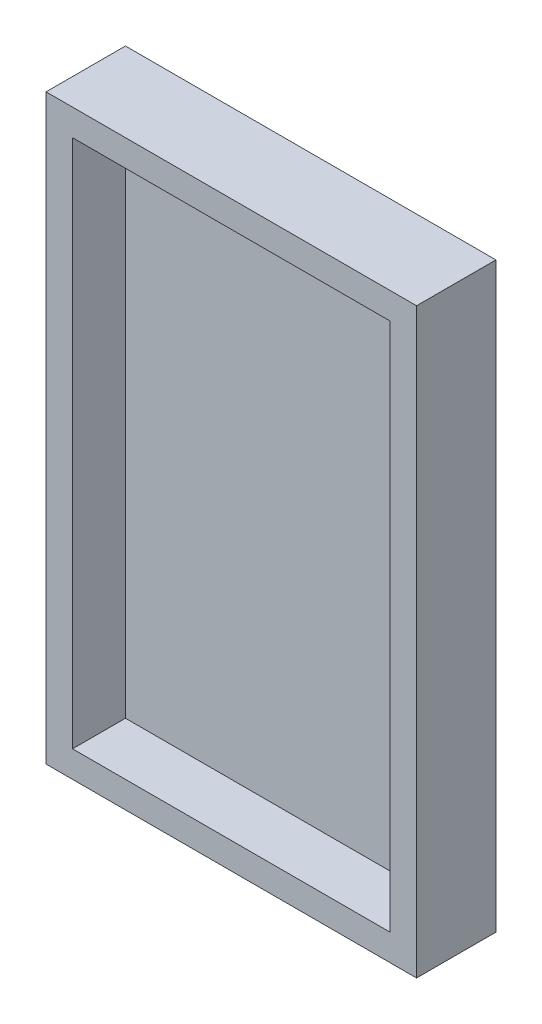
ISO-10303-21;
HEADER;
FILE_DESCRIPTION(('STEP AP214'),'2;1');
FILE_NAME('part.step','',(''),(''),'','','');
FILE_SCHEMA(('AUTOMOTIVE_DESIGN { 1 0 10303 214 1 1 1 1 }'));
ENDSEC;
DATA;
#1=APPLICATION_CONTEXT('core data for automotive mechanical design processes');
#2=APPLICATION_PROTOCOL_DEFINITION('international standard','automotive_design',2000,#1);
#3=PRODUCT_CONTEXT('',#1,'mechanical');
#4=PRODUCT('Part','Part','',(#3));
#5=PRODUCT_RELATED_PRODUCT_CATEGORY('part','',(#4));
#6=PRODUCT_DEFINITION_FORMATION('','',#4);
#7=PRODUCT_DEFINITION_CONTEXT('part definition',#1,'design');
#8=PRODUCT_DEFINITION('design','',#6,#7);
#9=PRODUCT_DEFINITION_SHAPE('','',#8);
#10=(LENGTH_UNIT() NAMED_UNIT(*) SI_UNIT(.MILLI.,.METRE.));
#11=(NAMED_UNIT(*) PLANE_ANGLE_UNIT() SI_UNIT($,.RADIAN.));
#12=(NAMED_UNIT(*) SI_UNIT($,.STERADIAN.) SOLID_ANGLE_UNIT());
#13=UNCERTAINTY_MEASURE_WITH_UNIT(LENGTH_MEASURE(1.E-05),#10,'distance_accuracy_value','');
#14=(GEOMETRIC_REPRESENTATION_CONTEXT(3) GLOBAL_UNCERTAINTY_ASSIGNED_CONTEXT((#13)) GLOBAL_UNIT_ASSIGNED_CONTEXT((#10,
#11,#12)) REPRESENTATION_CONTEXT('',''));
#15=CARTESIAN_POINT('',(0.,0.,0.));
#16=DIRECTION('',(0.,0.,1.));
#17=DIRECTION('',(1.,0.,0.));
#18=AXIS2_PLACEMENT_3D('',#15,#16,#17);
#19=CARTESIAN_POINT('',(0.,0.,10.));
#20=DIRECTION('',(0.,0.,1.));
#21=DIRECTION('',(1.,0.,0.));
#22=AXIS2_PLACEMENT_3D('',#19,#20,#21);
#23=PLANE('',#22);
#24=DIRECTION('',(0.,-1.,0.));
#25=VECTOR('',#24,1.);
#26=CARTESIAN_POINT('',(-126.004514672686,207.629796839729,10.));
#27=LINE('',#26,#25);
#28=CARTESIAN_POINT('',(-126.004514672686,207.629796839729,10.));
#29=VERTEX_POINT('',#28);
#30=CARTESIAN_POINT('',(-126.004514672686,7.62979683972909,10.));
#31=VERTEX_POINT('',#30);
#32=EDGE_CURVE('E136',#29,#31,#27,.T.);
#33=ORIENTED_EDGE('',*,*,#32,.T.);
#34=DIRECTION('',(1.,0.,0.));
#35=VECTOR('',#34,1.);
#36=CARTESIAN_POINT('',(-126.004514672686,7.62979683972909,10.));
#37=LINE('',#36,#35);
#38=CARTESIAN_POINT('',(-6.00451467268623,7.62979683972909,10.));
#39=VERTEX_POINT('',#38);
#40=EDGE_CURVE('E11',#31,#39,#37,.T.);
#41=ORIENTED_EDGE('',*,*,#40,.T.);
#42=DIRECTION('',(0.,1.,0.));
#43=VECTOR('',#42,1.);
#44=CARTESIAN_POINT('',(-6.00451467268626,207.629796839729,10.));
#45=LINE('',#44,#43);
#46=CARTESIAN_POINT('',(-6.00451467268626,207.629796839729,10.));
#47=VERTEX_POINT('',#46);
#48=EDGE_CURVE('E148',#39,#47,#45,.T.);
#49=ORIENTED_EDGE('',*,*,#48,.T.);
#50=DIRECTION('',(-1.,0.,0.));
#51=VECTOR('',#50,1.);
#52=CARTESIAN_POINT('',(-126.004514672686,207.629796839729,10.));
#53=LINE('',#52,#51);
#54=EDGE_CURVE('E145',#47,#29,#53,.T.);
#55=ORIENTED_EDGE('',*,*,#54,.T.);
#56=EDGE_LOOP('',(#33,#41,#49,#55));
#57=FACE_BOUND('',#56,.T.);
#58=ADVANCED_FACE('F17',(#57),#23,.T.);
#59=CARTESIAN_POINT('',(-126.004514672686,7.62979683972909,10.));
#60=DIRECTION('',(0.,-1.,0.));
#61=DIRECTION('',(0.,0.,-1.));
#62=AXIS2_PLACEMENT_3D('',#59,#60,#61);
#63=PLANE('',#62);
#64=DIRECTION('',(1.,0.,0.));
#65=VECTOR('',#64,1.);
#66=CARTESIAN_POINT('',(-126.004514672686,7.62979683972909,30.));
#67=LINE('',#66,#65);
#68=CARTESIAN_POINT('',(-126.004514672686,7.62979683972909,30.));
#69=VERTEX_POINT('',#68);
#70=CARTESIAN_POINT('',(-6.00451467268623,7.62979683972909,30.));
#71=VERTEX_POINT('',#70);
#72=EDGE_CURVE('E141',#69,#71,#67,.T.);
#73=ORIENTED_EDGE('',*,*,#72,.T.);
#74=DIRECTION('',(0.,0.,1.));
#75=VECTOR('',#74,1.);
#76=CARTESIAN_POINT('',(-6.00451467268623,7.62979683972909,10.));
#77=LINE('',#76,#75);
#78=EDGE_CURVE('E27',#39,#71,#77,.T.);
#79=ORIENTED_EDGE('',*,*,#78,.F.);
#80=ORIENTED_EDGE('',*,*,#40,.F.);
#81=DIRECTION('',(0.,0.,1.));
#82=VECTOR('',#81,1.);
#83=CARTESIAN_POINT('',(-126.004514672686,7.62979683972909,10.));
#84=LINE('',#83,#82);
#85=EDGE_CURVE('E185',#31,#69,#84,.T.);
#86=ORIENTED_EDGE('',*,*,#85,.T.);
#87=EDGE_LOOP('',(#73,#79,#80,#86));
#88=FACE_BOUND('',#87,.T.);
#89=ADVANCED_FACE('F206',(#88),#63,.F.);
#90=CARTESIAN_POINT('',(-6.00451467268626,207.629796839729,10.));
#91=DIRECTION('',(1.,0.,0.));
#92=DIRECTION('',(0.,1.,0.));
#93=AXIS2_PLACEMENT_3D('',#90,#91,#92);
#94=PLANE('',#93);
#95=DIRECTION('',(0.,1.,0.));
#96=VECTOR('',#95,1.);
#97=CARTESIAN_POINT('',(-6.00451467268626,207.629796839729,30.));
#98=LINE('',#97,#96);
#99=CARTESIAN_POINT('',(-6.00451467268626,207.629796839729,30.));
#100=VERTEX_POINT('',#99);
#101=EDGE_CURVE('E174',#71,#100,#98,.T.);
#102=ORIENTED_EDGE('',*,*,#101,.T.);
#103=DIRECTION('',(0.,0.,1.));
#104=VECTOR('',#103,1.);
#105=CARTESIAN_POINT('',(-6.00451467268626,207.629796839729,10.));
#106=LINE('',#105,#104);
#107=EDGE_CURVE('E151',#47,#100,#106,.T.);
#108=ORIENTED_EDGE('',*,*,#107,.F.);
#109=ORIENTED_EDGE('',*,*,#48,.F.);
#110=ORIENTED_EDGE('',*,*,#78,.T.);
#111=EDGE_LOOP('',(#102,#108,#109,#110));
#112=FACE_BOUND('',#111,.T.);
#113=ADVANCED_FACE('F210',(#112),#94,.F.);
#114=CARTESIAN_POINT('',(-126.004514672686,207.629796839729,10.));
#115=DIRECTION('',(0.,1.,0.));
#116=DIRECTION('',(1.,0.,0.));
#117=AXIS2_PLACEMENT_3D('',#114,#115,#116);
#118=PLANE('',#117);
#119=DIRECTION('',(-1.,0.,0.));
#120=VECTOR('',#119,1.);
#121=CARTESIAN_POINT('',(-126.004514672686,207.629796839729,30.));
#122=LINE('',#121,#120);
#123=CARTESIAN_POINT('',(-126.004514672686,207.629796839729,30.));
#124=VERTEX_POINT('',#123);
#125=EDGE_CURVE('E169',#100,#124,#122,.T.);
#126=ORIENTED_EDGE('',*,*,#125,.T.);
#127=DIRECTION('',(0.,0.,1.));
#128=VECTOR('',#127,1.);
#129=CARTESIAN_POINT('',(-126.004514672686,207.629796839729,10.));
#130=LINE('',#129,#128);
#131=EDGE_CURVE('E142',#29,#124,#130,.T.);
#132=ORIENTED_EDGE('',*,*,#131,.F.);
#133=ORIENTED_EDGE('',*,*,#54,.F.);
#134=ORIENTED_EDGE('',*,*,#107,.T.);
#135=EDGE_LOOP('',(#126,#132,#133,#134));
#136=FACE_BOUND('',#135,.T.);
#137=ADVANCED_FACE('F212',(#136),#118,.F.);
#138=CARTESIAN_POINT('',(-126.004514672686,207.629796839729,10.));
#139=DIRECTION('',(-1.,0.,0.));
#140=DIRECTION('',(0.,0.,1.));
#141=AXIS2_PLACEMENT_3D('',#138,#139,#140);
#142=PLANE('',#141);
#143=DIRECTION('',(0.,-1.,0.));
#144=VECTOR('',#143,1.);
#145=CARTESIAN_POINT('',(-126.004514672686,207.629796839729,30.));
#146=LINE('',#145,#144);
#147=EDGE_CURVE('E155',#124,#69,#146,.T.);
#148=ORIENTED_EDGE('',*,*,#147,.T.);
#149=ORIENTED_EDGE('',*,*,#85,.F.);
#150=ORIENTED_EDGE('',*,*,#32,.F.);
#151=ORIENTED_EDGE('',*,*,#131,.T.);
#152=EDGE_LOOP('',(#148,#149,#150,#151));
#153=FACE_BOUND('',#152,.T.);
#154=ADVANCED_FACE('F197',(#153),#142,.F.);
#155=CARTESIAN_POINT('',(0.,0.,0.));
#156=DIRECTION('',(0.,0.,-1.));
#157=DIRECTION('',(0.,-1.,0.));
#158=AXIS2_PLACEMENT_3D('',#155,#156,#157);
#159=PLANE('',#158);
#160=DIRECTION('',(1.,0.,0.));
#161=VECTOR('',#160,1.);
#162=CARTESIAN_POINT('',(-136.004514672686,217.629796839729,0.));
#163=LINE('',#162,#161);
#164=CARTESIAN_POINT('',(-136.004514672686,217.629796839729,0.));
#165=VERTEX_POINT('',#164);
#166=CARTESIAN_POINT('',(3.99548532731374,217.629796839729,0.));
#167=VERTEX_POINT('',#166);
#168=EDGE_CURVE('E20',#165,#167,#163,.T.);
#169=ORIENTED_EDGE('',*,*,#168,.T.);
#170=DIRECTION('',(0.,-1.,0.));
#171=VECTOR('',#170,1.);
#172=CARTESIAN_POINT('',(3.99548532731374,217.629796839729,0.));
#173=LINE('',#172,#171);
#174=CARTESIAN_POINT('',(3.99548532731377,-2.37020316027088,0.));
#175=VERTEX_POINT('',#174);
#176=EDGE_CURVE('E92',#167,#175,#173,.T.);
#177=ORIENTED_EDGE('',*,*,#176,.T.);
#178=DIRECTION('',(1.,0.,0.));
#179=VECTOR('',#178,1.);
#180=CARTESIAN_POINT('',(-136.004514672686,-2.37020316027088,0.));
#181=LINE('',#180,#179);
#182=CARTESIAN_POINT('',(-136.004514672686,-2.37020316027088,0.));
#183=VERTEX_POINT('',#182);
#184=EDGE_CURVE('E161',#183,#175,#181,.T.);
#185=ORIENTED_EDGE('',*,*,#184,.F.);
#186=DIRECTION('',(0.,-1.,0.));
#187=VECTOR('',#186,1.);
#188=CARTESIAN_POINT('',(-136.004514672686,217.629796839729,0.));
#189=LINE('',#188,#187);
#190=EDGE_CURVE('E114',#165,#183,#189,.T.);
#191=ORIENTED_EDGE('',*,*,#190,.F.);
#192=EDGE_LOOP('',(#169,#177,#185,#191));
#193=FACE_BOUND('',#192,.T.);
#194=ADVANCED_FACE('F116',(#193),#159,.T.);
#195=CARTESIAN_POINT('',(0.,0.,30.));
#196=DIRECTION('',(0.,0.,-1.));
#197=DIRECTION('',(0.,-1.,0.));
#198=AXIS2_PLACEMENT_3D('',#195,#196,#197);
#199=PLANE('',#198);
#200=ORIENTED_EDGE('',*,*,#72,.F.);
#201=ORIENTED_EDGE('',*,*,#147,.F.);
#202=ORIENTED_EDGE('',*,*,#125,.F.);
#203=ORIENTED_EDGE('',*,*,#101,.F.);
#204=EDGE_LOOP('',(#200,#201,#202,#203));
#205=FACE_BOUND('',#204,.T.);
#206=DIRECTION('',(1.,0.,0.));
#207=VECTOR('',#206,1.);
#208=CARTESIAN_POINT('',(-136.004514672686,217.629796839729,30.));
#209=LINE('',#208,#207);
#210=CARTESIAN_POINT('',(-136.004514672686,217.629796839729,30.));
#211=VERTEX_POINT('',#210);
#212=CARTESIAN_POINT('',(3.99548532731374,217.629796839729,30.));
#213=VERTEX_POINT('',#212);
#214=EDGE_CURVE('E112',#211,#213,#209,.T.);
#215=ORIENTED_EDGE('',*,*,#214,.F.);
#216=DIRECTION('',(0.,-1.,0.));
#217=VECTOR('',#216,1.);
#218=CARTESIAN_POINT('',(-136.004514672686,217.629796839729,30.));
#219=LINE('',#218,#217);
#220=CARTESIAN_POINT('',(-136.004514672686,-2.37020316027088,30.));
#221=VERTEX_POINT('',#220);
#222=EDGE_CURVE('E160',#211,#221,#219,.T.);
#223=ORIENTED_EDGE('',*,*,#222,.T.);
#224=DIRECTION('',(1.,0.,0.));
#225=VECTOR('',#224,1.);
#226=CARTESIAN_POINT('',(-136.004514672686,-2.37020316027088,30.));
#227=LINE('',#226,#225);
#228=CARTESIAN_POINT('',(3.99548532731377,-2.37020316027088,30.));
#229=VERTEX_POINT('',#228);
#230=EDGE_CURVE('E105',#221,#229,#227,.T.);
#231=ORIENTED_EDGE('',*,*,#230,.T.);
#232=DIRECTION('',(0.,-1.,0.));
#233=VECTOR('',#232,1.);
#234=CARTESIAN_POINT('',(3.99548532731374,217.629796839729,30.));
#235=LINE('',#234,#233);
#236=EDGE_CURVE('E104',#213,#229,#235,.T.);
#237=ORIENTED_EDGE('',*,*,#236,.F.);
#238=EDGE_LOOP('',(#215,#223,#231,#237));
#239=FACE_BOUND('',#238,.T.);
#240=ADVANCED_FACE('F204',(#205,#239),#199,.F.);
#241=CARTESIAN_POINT('',(3.99548532731374,217.629796839729,30.));
#242=DIRECTION('',(1.,0.,0.));
#243=DIRECTION('',(0.,1.,0.));
#244=AXIS2_PLACEMENT_3D('',#241,#242,#243);
#245=PLANE('',#244);
#246=ORIENTED_EDGE('',*,*,#176,.F.);
#247=DIRECTION('',(0.,0.,-1.));
#248=VECTOR('',#247,1.);
#249=CARTESIAN_POINT('',(3.99548532731374,217.629796839729,30.));
#250=LINE('',#249,#248);
#251=EDGE_CURVE('E96',#213,#167,#250,.T.);
#252=ORIENTED_EDGE('',*,*,#251,.F.);
#253=ORIENTED_EDGE('',*,*,#236,.T.);
#254=DIRECTION('',(0.,0.,-1.));
#255=VECTOR('',#254,1.);
#256=CARTESIAN_POINT('',(3.99548532731377,-2.37020316027088,30.));
#257=LINE('',#256,#255);
#258=EDGE_CURVE('E99',#229,#175,#257,.T.);
#259=ORIENTED_EDGE('',*,*,#258,.T.);
#260=EDGE_LOOP('',(#246,#252,#253,#259));
#261=FACE_BOUND('',#260,.T.);
#262=ADVANCED_FACE('F94',(#261),#245,.T.);
#263=CARTESIAN_POINT('',(-136.004514672686,-2.37020316027088,30.));
#264=DIRECTION('',(0.,1.,0.));
#265=DIRECTION('',(1.,0.,0.));
#266=AXIS2_PLACEMENT_3D('',#263,#264,#265);
#267=PLANE('',#266);
#268=ORIENTED_EDGE('',*,*,#184,.T.);
#269=ORIENTED_EDGE('',*,*,#258,.F.);
#270=ORIENTED_EDGE('',*,*,#230,.F.);
#271=DIRECTION('',(0.,0.,-1.));
#272=VECTOR('',#271,1.);
#273=CARTESIAN_POINT('',(-136.004514672686,-2.37020316027088,30.));
#274=LINE('',#273,#272);
#275=EDGE_CURVE('E156',#221,#183,#274,.T.);
#276=ORIENTED_EDGE('',*,*,#275,.T.);
#277=EDGE_LOOP('',(#268,#269,#270,#276));
#278=FACE_BOUND('',#277,.T.);
#279=ADVANCED_FACE('F239',(#278),#267,.F.);
#280=CARTESIAN_POINT('',(-136.004514672686,217.629796839729,30.));
#281=DIRECTION('',(1.,0.,0.));
#282=DIRECTION('',(0.,1.,0.));
#283=AXIS2_PLACEMENT_3D('',#280,#281,#282);
#284=PLANE('',#283);
#285=ORIENTED_EDGE('',*,*,#190,.T.);
#286=ORIENTED_EDGE('',*,*,#275,.F.);
#287=ORIENTED_EDGE('',*,*,#222,.F.);
#288=DIRECTION('',(0.,0.,-1.));
#289=VECTOR('',#288,1.);
#290=CARTESIAN_POINT('',(-136.004514672686,217.629796839729,30.));
#291=LINE('',#290,#289);
#292=EDGE_CURVE('E120',#211,#165,#291,.T.);
#293=ORIENTED_EDGE('',*,*,#292,.T.);
#294=EDGE_LOOP('',(#285,#286,#287,#293));
#295=FACE_BOUND('',#294,.T.);
#296=ADVANCED_FACE('F235',(#295),#284,.F.);
#297=CARTESIAN_POINT('',(-136.004514672686,217.629796839729,30.));
#298=DIRECTION('',(0.,1.,0.));
#299=DIRECTION('',(1.,0.,0.));
#300=AXIS2_PLACEMENT_3D('',#297,#298,#299);
#301=PLANE('',#300);
#302=ORIENTED_EDGE('',*,*,#168,.F.);
#303=ORIENTED_EDGE('',*,*,#292,.F.);
#304=ORIENTED_EDGE('',*,*,#214,.T.);
#305=ORIENTED_EDGE('',*,*,#251,.T.);
#306=EDGE_LOOP('',(#302,#303,#304,#305));
#307=FACE_BOUND('',#306,.T.);
#308=ADVANCED_FACE('F109',(#307),#301,.T.);
#309=CLOSED_SHELL('',(#58,#89,#113,#137,#154,#194,#240,#262,#279,#296,#308));
#310=MANIFOLD_SOLID_BREP('B1',#309);
#311=ADVANCED_BREP_SHAPE_REPRESENTATION('',(#18,#310),#14);
#312=SHAPE_DEFINITION_REPRESENTATION(#9,#311);
ENDSEC;
END-ISO-10303-21;
